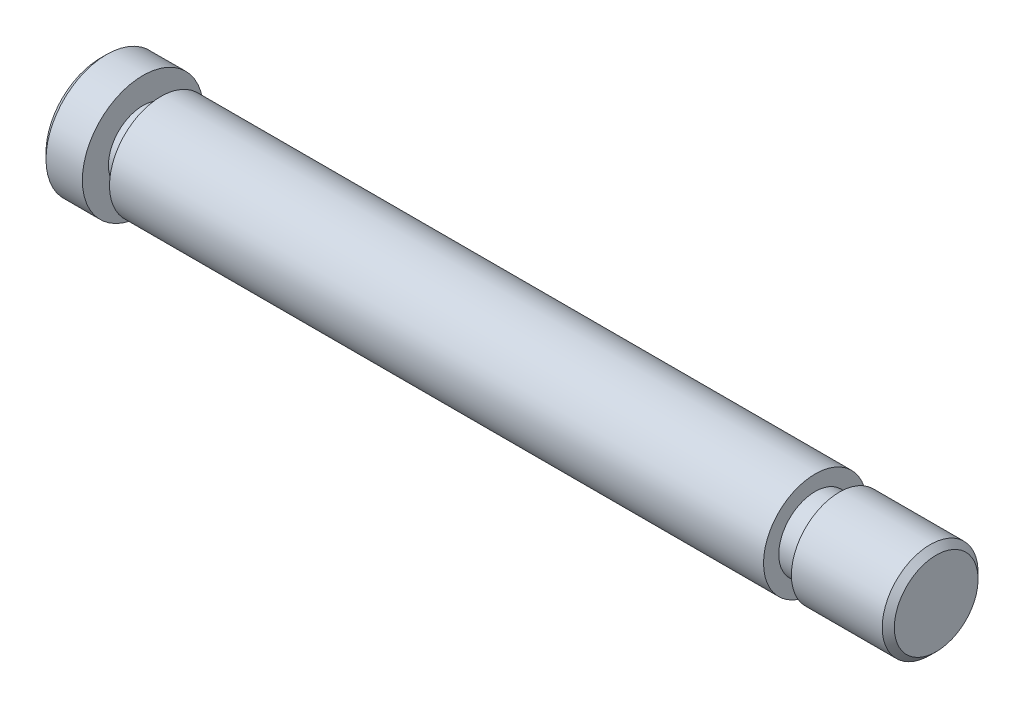
ISO-10303-21;
HEADER;
FILE_DESCRIPTION(('STEP AP214'),'2;1');
FILE_NAME('part.step','',(''),(''),'','','');
FILE_SCHEMA(('AUTOMOTIVE_DESIGN { 1 0 10303 214 1 1 1 1 }'));
ENDSEC;
DATA;
#1=APPLICATION_CONTEXT('core data for automotive mechanical design processes');
#2=APPLICATION_PROTOCOL_DEFINITION('international standard','automotive_design',2000,#1);
#3=PRODUCT_CONTEXT('',#1,'mechanical');
#4=PRODUCT('Part','Part','',(#3));
#5=PRODUCT_RELATED_PRODUCT_CATEGORY('part','',(#4));
#6=PRODUCT_DEFINITION_FORMATION('','',#4);
#7=PRODUCT_DEFINITION_CONTEXT('part definition',#1,'design');
#8=PRODUCT_DEFINITION('design','',#6,#7);
#9=PRODUCT_DEFINITION_SHAPE('','',#8);
#10=(LENGTH_UNIT() NAMED_UNIT(*) SI_UNIT(.MILLI.,.METRE.));
#11=(NAMED_UNIT(*) PLANE_ANGLE_UNIT() SI_UNIT($,.RADIAN.));
#12=(NAMED_UNIT(*) SI_UNIT($,.STERADIAN.) SOLID_ANGLE_UNIT());
#13=UNCERTAINTY_MEASURE_WITH_UNIT(LENGTH_MEASURE(1.E-05),#10,'distance_accuracy_value','');
#14=(GEOMETRIC_REPRESENTATION_CONTEXT(3) GLOBAL_UNCERTAINTY_ASSIGNED_CONTEXT((#13)) GLOBAL_UNIT_ASSIGNED_CONTEXT((#10,
#11,#12)) REPRESENTATION_CONTEXT('',''));
#15=CARTESIAN_POINT('',(0.,0.,0.));
#16=DIRECTION('',(0.,0.,1.));
#17=DIRECTION('',(1.,0.,0.));
#18=AXIS2_PLACEMENT_3D('',#15,#16,#17);
#19=CARTESIAN_POINT('',(-14.9703868086401,0.,0.));
#20=DIRECTION('',(-1.,0.,0.));
#21=DIRECTION('',(0.,0.,1.));
#22=AXIS2_PLACEMENT_3D('',#19,#20,#21);
#23=CYLINDRICAL_SURFACE('',#22,1.5);
#24=CARTESIAN_POINT('',(16.9766424505974,0.,0.));
#25=DIRECTION('',(-1.,0.,0.));
#26=DIRECTION('',(0.,0.,1.));
#27=AXIS2_PLACEMENT_3D('',#24,#25,#26);
#28=CIRCLE('',#27,1.5);
#29=CARTESIAN_POINT('',(16.9766424505974,0.,1.5));
#30=VERTEX_POINT('',#29);
#31=EDGE_CURVE('E81',#30,#30,#28,.T.);
#32=ORIENTED_EDGE('',*,*,#31,.F.);
#33=EDGE_LOOP('',(#32));
#34=FACE_BOUND('',#33,.T.);
#35=CARTESIAN_POINT('',(-8.52335754940258,0.,0.));
#36=DIRECTION('',(-1.,0.,0.));
#37=DIRECTION('',(0.,0.,1.));
#38=AXIS2_PLACEMENT_3D('',#35,#36,#37);
#39=CIRCLE('',#38,1.5);
#40=CARTESIAN_POINT('',(-8.52335754940258,0.,1.5));
#41=VERTEX_POINT('',#40);
#42=EDGE_CURVE('E54',#41,#41,#39,.T.);
#43=ORIENTED_EDGE('',*,*,#42,.T.);
#44=EDGE_LOOP('',(#43));
#45=FACE_BOUND('',#44,.T.);
#46=ADVANCED_FACE('F33',(#34,#45),#23,.F.);
#47=CARTESIAN_POINT('',(-8.52335754940258,1.5,0.));
#48=DIRECTION('',(1.,0.,0.));
#49=DIRECTION('',(0.,0.,-1.));
#50=AXIS2_PLACEMENT_3D('',#47,#48,#49);
#51=PLANE('',#50);
#52=CARTESIAN_POINT('',(-8.52335754940258,0.,0.));
#53=DIRECTION('',(1.,0.,0.));
#54=DIRECTION('',(0.,0.,-1.));
#55=AXIS2_PLACEMENT_3D('',#52,#53,#54);
#56=CIRCLE('',#55,4.50000000000001);
#57=CARTESIAN_POINT('',(-8.52335754940258,0.,-4.50000000000001));
#58=VERTEX_POINT('',#57);
#59=EDGE_CURVE('E49',#58,#58,#56,.F.);
#60=ORIENTED_EDGE('',*,*,#59,.T.);
#61=EDGE_LOOP('',(#60));
#62=FACE_BOUND('',#61,.T.);
#63=ORIENTED_EDGE('',*,*,#42,.F.);
#64=EDGE_LOOP('',(#63));
#65=FACE_BOUND('',#64,.T.);
#66=ADVANCED_FACE('F89',(#62,#65),#51,.F.);
#67=CARTESIAN_POINT('',(-14.9703868086401,0.,0.));
#68=DIRECTION('',(-1.,0.,0.));
#69=DIRECTION('',(0.,0.,1.));
#70=AXIS2_PLACEMENT_3D('',#67,#68,#69);
#71=CYLINDRICAL_SURFACE('',#70,5.);
#72=CARTESIAN_POINT('',(-8.02335754940259,0.,0.));
#73=DIRECTION('',(1.,0.,0.));
#74=DIRECTION('',(0.,0.,-1.));
#75=AXIS2_PLACEMENT_3D('',#72,#73,#74);
#76=CIRCLE('',#75,5.);
#77=CARTESIAN_POINT('',(-8.02335754940259,0.,-5.));
#78=VERTEX_POINT('',#77);
#79=EDGE_CURVE('E45',#78,#78,#76,.T.);
#80=ORIENTED_EDGE('',*,*,#79,.T.);
#81=EDGE_LOOP('',(#80));
#82=FACE_BOUND('',#81,.T.);
#83=CARTESIAN_POINT('',(-5.02335754940258,0.,0.));
#84=DIRECTION('',(-1.,0.,0.));
#85=DIRECTION('',(0.,0.,1.));
#86=AXIS2_PLACEMENT_3D('',#83,#84,#85);
#87=CIRCLE('',#86,5.);
#88=CARTESIAN_POINT('',(-5.02335754940258,0.,5.));
#89=VERTEX_POINT('',#88);
#90=EDGE_CURVE('E57',#89,#89,#87,.T.);
#91=ORIENTED_EDGE('',*,*,#90,.T.);
#92=EDGE_LOOP('',(#91));
#93=FACE_BOUND('',#92,.T.);
#94=ADVANCED_FACE('F94',(#82,#93),#71,.T.);
#95=CARTESIAN_POINT('',(-5.02335754940258,5.,0.));
#96=DIRECTION('',(-1.,0.,0.));
#97=DIRECTION('',(0.,0.,1.));
#98=AXIS2_PLACEMENT_3D('',#95,#96,#97);
#99=PLANE('',#98);
#100=ORIENTED_EDGE('',*,*,#90,.F.);
#101=EDGE_LOOP('',(#100));
#102=FACE_BOUND('',#101,.T.);
#103=CARTESIAN_POINT('',(-5.02335754940258,0.,0.));
#104=DIRECTION('',(-1.,0.,0.));
#105=DIRECTION('',(0.,0.,1.));
#106=AXIS2_PLACEMENT_3D('',#103,#104,#105);
#107=CIRCLE('',#106,2.8460830321485);
#108=CARTESIAN_POINT('',(-5.02335754940258,0.,2.8460830321485));
#109=VERTEX_POINT('',#108);
#110=EDGE_CURVE('E60',#109,#109,#107,.T.);
#111=ORIENTED_EDGE('',*,*,#110,.T.);
#112=EDGE_LOOP('',(#111));
#113=FACE_BOUND('',#112,.T.);
#114=ADVANCED_FACE('F100',(#102,#113),#99,.F.);
#115=CARTESIAN_POINT('',(-14.9703868086401,0.,0.));
#116=DIRECTION('',(-1.,0.,0.));
#117=DIRECTION('',(0.,0.,1.));
#118=AXIS2_PLACEMENT_3D('',#115,#116,#117);
#119=CYLINDRICAL_SURFACE('',#118,2.8460830321485);
#120=ORIENTED_EDGE('',*,*,#110,.F.);
#121=EDGE_LOOP('',(#120));
#122=FACE_BOUND('',#121,.T.);
#123=CARTESIAN_POINT('',(-3.52335754940258,0.,0.));
#124=DIRECTION('',(-1.,0.,0.));
#125=DIRECTION('',(0.,0.,1.));
#126=AXIS2_PLACEMENT_3D('',#123,#124,#125);
#127=CIRCLE('',#126,2.8460830321485);
#128=CARTESIAN_POINT('',(-3.52335754940258,0.,2.8460830321485));
#129=VERTEX_POINT('',#128);
#130=EDGE_CURVE('E63',#129,#129,#127,.T.);
#131=ORIENTED_EDGE('',*,*,#130,.T.);
#132=EDGE_LOOP('',(#131));
#133=FACE_BOUND('',#132,.T.);
#134=ADVANCED_FACE('F125',(#122,#133),#119,.T.);
#135=CARTESIAN_POINT('',(-3.52335754940258,2.8460830321485,0.));
#136=DIRECTION('',(1.,0.,0.));
#137=DIRECTION('',(0.,0.,-1.));
#138=AXIS2_PLACEMENT_3D('',#135,#136,#137);
#139=PLANE('',#138);
#140=ORIENTED_EDGE('',*,*,#130,.F.);
#141=EDGE_LOOP('',(#140));
#142=FACE_BOUND('',#141,.T.);
#143=CARTESIAN_POINT('',(-3.52335754940258,0.,0.));
#144=DIRECTION('',(-1.,0.,0.));
#145=DIRECTION('',(0.,0.,1.));
#146=AXIS2_PLACEMENT_3D('',#143,#144,#145);
#147=CIRCLE('',#146,4.25768905369791);
#148=CARTESIAN_POINT('',(-3.52335754940258,0.,4.25768905369791));
#149=VERTEX_POINT('',#148);
#150=EDGE_CURVE('E66',#149,#149,#147,.T.);
#151=ORIENTED_EDGE('',*,*,#150,.T.);
#152=EDGE_LOOP('',(#151));
#153=FACE_BOUND('',#152,.T.);
#154=ADVANCED_FACE('F130',(#142,#153),#139,.F.);
#155=CARTESIAN_POINT('',(-14.9703868086401,0.,0.));
#156=DIRECTION('',(-1.,0.,0.));
#157=DIRECTION('',(0.,0.,1.));
#158=AXIS2_PLACEMENT_3D('',#155,#156,#157);
#159=CYLINDRICAL_SURFACE('',#158,4.25768905369792);
#160=ORIENTED_EDGE('',*,*,#150,.F.);
#161=EDGE_LOOP('',(#160));
#162=FACE_BOUND('',#161,.T.);
#163=CARTESIAN_POINT('',(50.4766424505974,0.,0.));
#164=DIRECTION('',(-1.,0.,0.));
#165=DIRECTION('',(0.,0.,1.));
#166=AXIS2_PLACEMENT_3D('',#163,#164,#165);
#167=CIRCLE('',#166,4.25768905369793);
#168=CARTESIAN_POINT('',(50.4766424505974,0.,4.25768905369793));
#169=VERTEX_POINT('',#168);
#170=EDGE_CURVE('E69',#169,#169,#167,.T.);
#171=ORIENTED_EDGE('',*,*,#170,.T.);
#172=EDGE_LOOP('',(#171));
#173=FACE_BOUND('',#172,.T.);
#174=ADVANCED_FACE('F136',(#162,#173),#159,.T.);
#175=CARTESIAN_POINT('',(50.4766424505974,4.25768905369793,0.));
#176=DIRECTION('',(-1.,0.,0.));
#177=DIRECTION('',(0.,0.,1.));
#178=AXIS2_PLACEMENT_3D('',#175,#176,#177);
#179=PLANE('',#178);
#180=ORIENTED_EDGE('',*,*,#170,.F.);
#181=EDGE_LOOP('',(#180));
#182=FACE_BOUND('',#181,.T.);
#183=CARTESIAN_POINT('',(50.4766424505974,0.,0.));
#184=DIRECTION('',(-1.,0.,0.));
#185=DIRECTION('',(0.,0.,1.));
#186=AXIS2_PLACEMENT_3D('',#183,#184,#185);
#187=CIRCLE('',#186,3.);
#188=CARTESIAN_POINT('',(50.4766424505974,0.,3.));
#189=VERTEX_POINT('',#188);
#190=EDGE_CURVE('E72',#189,#189,#187,.T.);
#191=ORIENTED_EDGE('',*,*,#190,.T.);
#192=EDGE_LOOP('',(#191));
#193=FACE_BOUND('',#192,.T.);
#194=ADVANCED_FACE('F142',(#182,#193),#179,.F.);
#195=CARTESIAN_POINT('',(-14.9703868086401,0.,0.));
#196=DIRECTION('',(-1.,0.,0.));
#197=DIRECTION('',(0.,0.,1.));
#198=AXIS2_PLACEMENT_3D('',#195,#196,#197);
#199=CYLINDRICAL_SURFACE('',#198,3.);
#200=ORIENTED_EDGE('',*,*,#190,.F.);
#201=EDGE_LOOP('',(#200));
#202=FACE_BOUND('',#201,.T.);
#203=CARTESIAN_POINT('',(52.4766424505974,0.,0.));
#204=DIRECTION('',(-1.,0.,0.));
#205=DIRECTION('',(0.,0.,1.));
#206=AXIS2_PLACEMENT_3D('',#203,#204,#205);
#207=CIRCLE('',#206,3.);
#208=CARTESIAN_POINT('',(52.4766424505974,0.,3.));
#209=VERTEX_POINT('',#208);
#210=EDGE_CURVE('E75',#209,#209,#207,.T.);
#211=ORIENTED_EDGE('',*,*,#210,.T.);
#212=EDGE_LOOP('',(#211));
#213=FACE_BOUND('',#212,.T.);
#214=ADVANCED_FACE('F148',(#202,#213),#199,.T.);
#215=CARTESIAN_POINT('',(52.4766424505974,3.,0.));
#216=DIRECTION('',(1.,0.,0.));
#217=DIRECTION('',(0.,0.,-1.));
#218=AXIS2_PLACEMENT_3D('',#215,#216,#217);
#219=PLANE('',#218);
#220=ORIENTED_EDGE('',*,*,#210,.F.);
#221=EDGE_LOOP('',(#220));
#222=FACE_BOUND('',#221,.T.);
#223=CARTESIAN_POINT('',(52.4766424505974,0.,0.));
#224=DIRECTION('',(-1.,0.,0.));
#225=DIRECTION('',(0.,0.,1.));
#226=AXIS2_PLACEMENT_3D('',#223,#224,#225);
#227=CIRCLE('',#226,3.9564274175792);
#228=CARTESIAN_POINT('',(52.4766424505974,0.,3.9564274175792));
#229=VERTEX_POINT('',#228);
#230=EDGE_CURVE('E78',#229,#229,#227,.T.);
#231=ORIENTED_EDGE('',*,*,#230,.T.);
#232=EDGE_LOOP('',(#231));
#233=FACE_BOUND('',#232,.T.);
#234=ADVANCED_FACE('F154',(#222,#233),#219,.F.);
#235=CARTESIAN_POINT('',(-14.9703868086401,0.,0.));
#236=DIRECTION('',(-1.,0.,0.));
#237=DIRECTION('',(0.,0.,1.));
#238=AXIS2_PLACEMENT_3D('',#235,#236,#237);
#239=CYLINDRICAL_SURFACE('',#238,3.9564274175792);
#240=CARTESIAN_POINT('',(59.9766424505974,0.,0.));
#241=DIRECTION('',(-1.,0.,0.));
#242=DIRECTION('',(0.,0.,1.));
#243=AXIS2_PLACEMENT_3D('',#240,#241,#242);
#244=CIRCLE('',#243,3.9564274175792);
#245=CARTESIAN_POINT('',(59.9766424505974,0.,3.9564274175792));
#246=VERTEX_POINT('',#245);
#247=EDGE_CURVE('E41',#246,#246,#244,.T.);
#248=ORIENTED_EDGE('',*,*,#247,.T.);
#249=EDGE_LOOP('',(#248));
#250=FACE_BOUND('',#249,.T.);
#251=ORIENTED_EDGE('',*,*,#230,.F.);
#252=EDGE_LOOP('',(#251));
#253=FACE_BOUND('',#252,.T.);
#254=ADVANCED_FACE('F160',(#250,#253),#239,.T.);
#255=CARTESIAN_POINT('',(60.4766424505974,3.9564274175792,0.));
#256=DIRECTION('',(-1.,0.,0.));
#257=DIRECTION('',(0.,0.,1.));
#258=AXIS2_PLACEMENT_3D('',#255,#256,#257);
#259=PLANE('',#258);
#260=CARTESIAN_POINT('',(60.4766424505974,0.,0.));
#261=DIRECTION('',(-1.,0.,0.));
#262=DIRECTION('',(0.,0.,1.));
#263=AXIS2_PLACEMENT_3D('',#260,#261,#262);
#264=CIRCLE('',#263,3.4564274175792);
#265=CARTESIAN_POINT('',(60.4766424505974,0.,3.4564274175792));
#266=VERTEX_POINT('',#265);
#267=EDGE_CURVE('E10',#266,#266,#264,.F.);
#268=ORIENTED_EDGE('',*,*,#267,.T.);
#269=EDGE_LOOP('',(#268));
#270=FACE_BOUND('',#269,.T.);
#271=ADVANCED_FACE('F115',(#270),#259,.F.);
#272=CARTESIAN_POINT('',(16.9766424505974,1.5,0.));
#273=DIRECTION('',(1.,0.,0.));
#274=DIRECTION('',(0.,0.,-1.));
#275=AXIS2_PLACEMENT_3D('',#272,#273,#274);
#276=PLANE('',#275);
#277=ORIENTED_EDGE('',*,*,#31,.T.);
#278=EDGE_LOOP('',(#277));
#279=FACE_BOUND('',#278,.T.);
#280=ADVANCED_FACE('F85',(#279),#276,.F.);
#281=CARTESIAN_POINT('',(-8.52335754940258,0.,0.));
#282=DIRECTION('',(1.,0.,0.));
#283=DIRECTION('',(0.,0.,-1.));
#284=AXIS2_PLACEMENT_3D('',#281,#282,#283);
#285=CONICAL_SURFACE('',#284,4.50000000000001,0.785398163397444);
#286=ORIENTED_EDGE('',*,*,#79,.F.);
#287=EDGE_LOOP('',(#286));
#288=FACE_BOUND('',#287,.T.);
#289=ORIENTED_EDGE('',*,*,#59,.F.);
#290=EDGE_LOOP('',(#289));
#291=FACE_BOUND('',#290,.T.);
#292=ADVANCED_FACE('F105',(#288,#291),#285,.T.);
#293=CARTESIAN_POINT('',(59.9766424505974,0.,0.));
#294=DIRECTION('',(-1.,0.,0.));
#295=DIRECTION('',(0.,0.,1.));
#296=AXIS2_PLACEMENT_3D('',#293,#294,#295);
#297=CONICAL_SURFACE('',#296,3.9564274175792,0.785398163397453);
#298=ORIENTED_EDGE('',*,*,#267,.F.);
#299=EDGE_LOOP('',(#298));
#300=FACE_BOUND('',#299,.T.);
#301=ORIENTED_EDGE('',*,*,#247,.F.);
#302=EDGE_LOOP('',(#301));
#303=FACE_BOUND('',#302,.T.);
#304=ADVANCED_FACE('F36',(#300,#303),#297,.T.);
#305=CLOSED_SHELL('',(#46,#66,#94,#114,#134,#154,#174,#194,#214,#234,#254,#271,#280,#292,#304));
#306=MANIFOLD_SOLID_BREP('B2',#305);
#307=ADVANCED_BREP_SHAPE_REPRESENTATION('',(#18,#306),#14);
#308=SHAPE_DEFINITION_REPRESENTATION(#9,#307);
ENDSEC;
END-ISO-10303-21;
